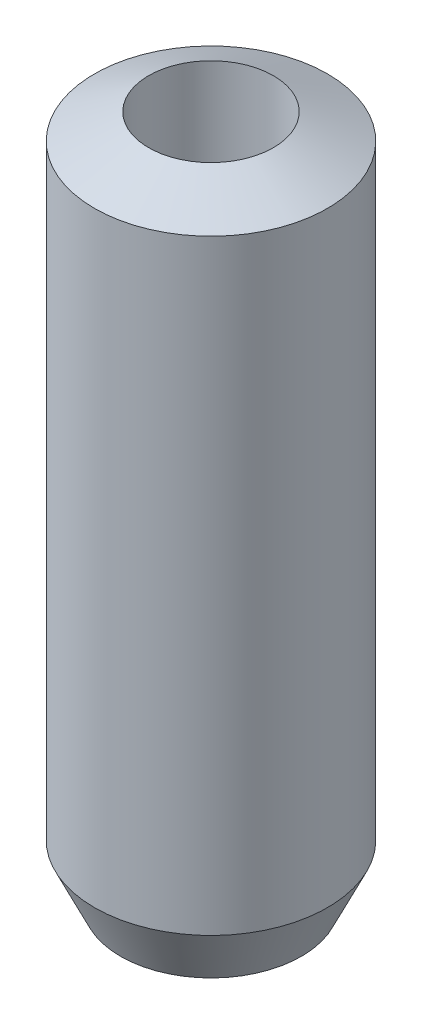
ISO-10303-21;
HEADER;
FILE_DESCRIPTION(('STEP AP214'),'2;1');
FILE_NAME('part.step','',(''),(''),'','','');
FILE_SCHEMA(('AUTOMOTIVE_DESIGN { 1 0 10303 214 1 1 1 1 }'));
ENDSEC;
DATA;
#1=APPLICATION_CONTEXT('core data for automotive mechanical design processes');
#2=APPLICATION_PROTOCOL_DEFINITION('international standard','automotive_design',2000,#1);
#3=PRODUCT_CONTEXT('',#1,'mechanical');
#4=PRODUCT('Part','Part','',(#3));
#5=PRODUCT_RELATED_PRODUCT_CATEGORY('part','',(#4));
#6=PRODUCT_DEFINITION_FORMATION('','',#4);
#7=PRODUCT_DEFINITION_CONTEXT('part definition',#1,'design');
#8=PRODUCT_DEFINITION('design','',#6,#7);
#9=PRODUCT_DEFINITION_SHAPE('','',#8);
#10=(LENGTH_UNIT() NAMED_UNIT(*) SI_UNIT(.MILLI.,.METRE.));
#11=(NAMED_UNIT(*) PLANE_ANGLE_UNIT() SI_UNIT($,.RADIAN.));
#12=(NAMED_UNIT(*) SI_UNIT($,.STERADIAN.) SOLID_ANGLE_UNIT());
#13=UNCERTAINTY_MEASURE_WITH_UNIT(LENGTH_MEASURE(1.E-05),#10,'distance_accuracy_value','');
#14=(GEOMETRIC_REPRESENTATION_CONTEXT(3) GLOBAL_UNCERTAINTY_ASSIGNED_CONTEXT((#13)) GLOBAL_UNIT_ASSIGNED_CONTEXT((#10,
#11,#12)) REPRESENTATION_CONTEXT('',''));
#15=CARTESIAN_POINT('',(0.,0.,0.));
#16=DIRECTION('',(0.,0.,1.));
#17=DIRECTION('',(1.,0.,0.));
#18=AXIS2_PLACEMENT_3D('',#15,#16,#17);
#19=CARTESIAN_POINT('',(0.,58.9361552721184,0.));
#20=DIRECTION('',(0.,-1.,0.));
#21=DIRECTION('',(0.,0.,-1.));
#22=AXIS2_PLACEMENT_3D('',#19,#20,#21);
#23=CYLINDRICAL_SURFACE('',#22,10.);
#24=CARTESIAN_POINT('',(0.,56.7048521358118,0.));
#25=DIRECTION('',(0.,1.,0.));
#26=DIRECTION('',(0.,0.,1.));
#27=AXIS2_PLACEMENT_3D('',#24,#25,#26);
#28=CIRCLE('',#27,10.);
#29=CARTESIAN_POINT('',(0.,56.7048521358118,-10.));
#30=VERTEX_POINT('',#29);
#31=EDGE_CURVE('E50',#30,#30,#28,.F.);
#32=ORIENTED_EDGE('',*,*,#31,.T.);
#33=EDGE_LOOP('',(#32));
#34=FACE_BOUND('',#33,.T.);
#35=CARTESIAN_POINT('',(0.,4.73732251438508,0.));
#36=DIRECTION('',(0.,1.,0.));
#37=DIRECTION('',(0.,0.,1.));
#38=AXIS2_PLACEMENT_3D('',#35,#36,#37);
#39=CIRCLE('',#38,10.);
#40=CARTESIAN_POINT('',(0.,4.73732251438508,10.));
#41=VERTEX_POINT('',#40);
#42=EDGE_CURVE('E51',#41,#41,#39,.T.);
#43=ORIENTED_EDGE('',*,*,#42,.T.);
#44=EDGE_LOOP('',(#43));
#45=FACE_BOUND('',#44,.T.);
#46=ADVANCED_FACE('F39',(#34,#45),#23,.T.);
#47=CARTESIAN_POINT('',(0.,0.,0.));
#48=DIRECTION('',(0.,1.,0.));
#49=DIRECTION('',(0.,0.,1.));
#50=AXIS2_PLACEMENT_3D('',#47,#48,#49);
#51=PLANE('',#50);
#52=CARTESIAN_POINT('',(0.,0.,0.));
#53=DIRECTION('',(0.,1.,0.));
#54=DIRECTION('',(0.,0.,1.));
#55=AXIS2_PLACEMENT_3D('',#52,#53,#54);
#56=CIRCLE('',#55,7.76869686369342);
#57=CARTESIAN_POINT('',(0.,0.,7.76869686369342));
#58=VERTEX_POINT('',#57);
#59=EDGE_CURVE('E10',#58,#58,#56,.F.);
#60=ORIENTED_EDGE('',*,*,#59,.T.);
#61=EDGE_LOOP('',(#60));
#62=FACE_BOUND('',#61,.T.);
#63=CARTESIAN_POINT('',(0.,0.,0.));
#64=DIRECTION('',(0.,1.,0.));
#65=DIRECTION('',(0.,0.,1.));
#66=AXIS2_PLACEMENT_3D('',#63,#64,#65);
#67=CIRCLE('',#66,5.35534448625057);
#68=CARTESIAN_POINT('',(0.,0.,5.35534448625057));
#69=VERTEX_POINT('',#68);
#70=EDGE_CURVE('E58',#69,#69,#67,.T.);
#71=ORIENTED_EDGE('',*,*,#70,.T.);
#72=EDGE_LOOP('',(#71));
#73=FACE_BOUND('',#72,.T.);
#74=ADVANCED_FACE('F62',(#62,#73),#51,.F.);
#75=CARTESIAN_POINT('',(0.,58.9361552721184,0.));
#76=DIRECTION('',(0.,-1.,0.));
#77=DIRECTION('',(0.,0.,-1.));
#78=AXIS2_PLACEMENT_3D('',#75,#76,#77);
#79=CYLINDRICAL_SURFACE('',#78,5.35534448625057);
#80=CARTESIAN_POINT('',(0.,58.892508640815,0.));
#81=DIRECTION('',(0.,-1.,0.));
#82=DIRECTION('',(0.,0.,-1.));
#83=AXIS2_PLACEMENT_3D('',#80,#81,#82);
#84=CIRCLE('',#83,5.35534448625057);
#85=CARTESIAN_POINT('',(0.,58.892508640815,-5.35534448625056));
#86=VERTEX_POINT('',#85);
#87=EDGE_CURVE('E54',#86,#86,#84,.F.);
#88=ORIENTED_EDGE('',*,*,#87,.T.);
#89=EDGE_LOOP('',(#88));
#90=FACE_BOUND('',#89,.T.);
#91=ORIENTED_EDGE('',*,*,#70,.F.);
#92=EDGE_LOOP('',(#91));
#93=FACE_BOUND('',#92,.T.);
#94=ADVANCED_FACE('F68',(#90,#93),#79,.F.);
#95=CARTESIAN_POINT('',(0.,58.9361552721184,0.));
#96=DIRECTION('',(0.,-1.,0.));
#97=DIRECTION('',(0.,0.,-1.));
#98=AXIS2_PLACEMENT_3D('',#95,#96,#97);
#99=CONICAL_SURFACE('',#98,5.26267748561476,1.13061250057541);
#100=CARTESIAN_POINT('',(0.,56.7048521358118,-10.));
#101=CARTESIAN_POINT('',(0.,56.7276402244056,-9.95161817173178));
#102=CARTESIAN_POINT('',(0.,56.7504283129994,-9.90323634346356));
#103=CARTESIAN_POINT('',(0.,56.796004490187,-9.80647268692712));
#104=CARTESIAN_POINT('',(0.,56.8187925787807,-9.75809085865889));
#105=CARTESIAN_POINT('',(0.,56.8643687559683,-9.66132720212245));
#106=CARTESIAN_POINT('',(0.,56.8871568445621,-9.61294537385422));
#107=CARTESIAN_POINT('',(0.,56.9327330217496,-9.51618171731777));
#108=CARTESIAN_POINT('',(0.,56.9555211103434,-9.46779988904955));
#109=CARTESIAN_POINT('',(0.,57.001097287531,-9.37103623251311));
#110=CARTESIAN_POINT('',(0.,57.0238853761248,-9.32265440424488));
#111=CARTESIAN_POINT('',(0.,57.0694615533124,-9.22589074770844));
#112=CARTESIAN_POINT('',(0.,57.0922496419061,-9.17750891944021));
#113=CARTESIAN_POINT('',(0.,57.1378258190937,-9.08074526290376));
#114=CARTESIAN_POINT('',(0.,57.1606139076875,-9.03236343463554));
#115=CARTESIAN_POINT('',(0.,57.206190084875,-8.93559977809909));
#116=CARTESIAN_POINT('',(0.,57.2289781734688,-8.88721794983087));
#117=CARTESIAN_POINT('',(0.,57.2745543506564,-8.79045429329443));
#118=CARTESIAN_POINT('',(0.,57.2973424392502,-8.7420724650262));
#119=CARTESIAN_POINT('',(0.,57.3429186164377,-8.64530880848975));
#120=CARTESIAN_POINT('',(0.,57.3657067050315,-8.59692698022153));
#121=CARTESIAN_POINT('',(0.,57.4112828822191,-8.50016332368508));
#122=CARTESIAN_POINT('',(0.,57.4340709708129,-8.45178149541686));
#123=CARTESIAN_POINT('',(0.,57.4796471480004,-8.35501783888041));
#124=CARTESIAN_POINT('',(0.,57.5024352365942,-8.30663601061219));
#125=CARTESIAN_POINT('',(0.,57.5480114137818,-8.20987235407574));
#126=CARTESIAN_POINT('',(0.,57.5707995023756,-8.16149052580752));
#127=CARTESIAN_POINT('',(0.,57.6163756795631,-8.06472686927107));
#128=CARTESIAN_POINT('',(0.,57.6391637681569,-8.01634504100285));
#129=CARTESIAN_POINT('',(0.,57.6847399453445,-7.9195813844664));
#130=CARTESIAN_POINT('',(0.,57.7075280339383,-7.87119955619818));
#131=CARTESIAN_POINT('',(0.,57.7531042111258,-7.77443589966173));
#132=CARTESIAN_POINT('',(0.,57.7758922997196,-7.72605407139351));
#133=CARTESIAN_POINT('',(0.,57.8214684769072,-7.62929041485706));
#134=CARTESIAN_POINT('',(0.,57.844256565501,-7.58090858658884));
#135=CARTESIAN_POINT('',(0.,57.8898327426886,-7.48414493005239));
#136=CARTESIAN_POINT('',(0.,57.9126208312823,-7.43576310178417));
#137=CARTESIAN_POINT('',(0.,57.9581970084699,-7.33899944524772));
#138=CARTESIAN_POINT('',(0.,57.9809850970637,-7.2906176169795));
#139=CARTESIAN_POINT('',(0.,58.0265612742513,-7.19385396044305));
#140=CARTESIAN_POINT('',(0.,58.049349362845,-7.14547213217483));
#141=CARTESIAN_POINT('',(0.,58.0949255400326,-7.04870847563838));
#142=CARTESIAN_POINT('',(0.,58.1177136286264,-7.00032664737016));
#143=CARTESIAN_POINT('',(0.,58.163289805814,-6.90356299083371));
#144=CARTESIAN_POINT('',(0.,58.1860778944077,-6.85518116256549));
#145=CARTESIAN_POINT('',(0.,58.2316540715953,-6.75841750602904));
#146=CARTESIAN_POINT('',(0.,58.2544421601891,-6.71003567776082));
#147=CARTESIAN_POINT('',(0.,58.3000183373766,-6.61327202122437));
#148=CARTESIAN_POINT('',(0.,58.3228064259704,-6.56489019295615));
#149=CARTESIAN_POINT('',(0.,58.368382603158,-6.4681265364197));
#150=CARTESIAN_POINT('',(0.,58.3911706917518,-6.41974470815148));
#151=CARTESIAN_POINT('',(0.,58.4367468689394,-6.32298105161503));
#152=CARTESIAN_POINT('',(0.,58.4595349575331,-6.27459922334681));
#153=CARTESIAN_POINT('',(0.,58.5051111347207,-6.17783556681036));
#154=CARTESIAN_POINT('',(0.,58.5278992233145,-6.12945373854214));
#155=CARTESIAN_POINT('',(0.,58.573475400502,-6.03269008200569));
#156=CARTESIAN_POINT('',(0.,58.5962634890958,-5.98430825373747));
#157=CARTESIAN_POINT('',(0.,58.6418396662834,-5.88754459720102));
#158=CARTESIAN_POINT('',(0.,58.6646277548772,-5.83916276893279));
#159=CARTESIAN_POINT('',(0.,58.7102039320648,-5.74239911239635));
#160=CARTESIAN_POINT('',(0.,58.7329920206585,-5.69401728412812));
#161=CARTESIAN_POINT('',(0.,58.7785681978461,-5.59725362759168));
#162=CARTESIAN_POINT('',(0.,58.8013562864399,-5.54887179932345));
#163=CARTESIAN_POINT('',(0.,58.8469324636274,-5.45210814278701));
#164=CARTESIAN_POINT('',(0.,58.8697205522212,-5.40372631451878));
#165=CARTESIAN_POINT('',(0.,58.892508640815,-5.35534448625056));
#166=B_SPLINE_CURVE_WITH_KNOTS('',3,(#100,#101,#102,#103,#104,#105,#106,#107,#108,#109,#110,
#111,#112,#113,#114,#115,#116,#117,#118,#119,#120,#121,#122,#123,#124,#125,#126,#127,#128,#129,
#130,#131,#132,#133,#134,#135,#136,#137,#138,#139,#140,#141,#142,#143,#144,#145,#146,#147,#148,
#149,#150,#151,#152,#153,#154,#155,#156,#157,#158,#159,#160,#161,#162,#163,#164,#165),
.UNSPECIFIED.,.F.,.F.,(4,2,2,2,2,2,2,2,2,2,2,2,2,2,2,2,2,2,2,2,2,2,2,2,2,2,2,2,2,2,2,2,4),(0.,
0.160439660293226,0.320879320586454,0.481318980879681,0.641758641172907,0.802198301466132,
0.962637961759359,1.12307762205258,1.28351728234581,1.44395694263904,1.60439660293226,
1.76483626322549,1.92527592351872,2.08571558381194,2.24615524410517,2.40659490439839,
2.56703456469162,2.72747422498485,2.88791388527808,3.0483535455713,3.20879320586453,
3.36923286615775,3.52967252645098,3.69011218674421,3.85055184703743,4.01099150733066,
4.17143116762388,4.33187082791711,4.49231048821034,4.65275014850356,4.81318980879679,
4.97362946909001,5.13406912938324),.UNSPECIFIED.);
#167=EDGE_CURVE('BSEAM66',#30,#86,#166,.T.);
#168=ORIENTED_EDGE('',*,*,#31,.F.);
#169=ORIENTED_EDGE('',*,*,#87,.F.);
#170=ORIENTED_EDGE('',*,*,#167,.T.);
#171=ORIENTED_EDGE('',*,*,#167,.F.);
#172=EDGE_LOOP('',(#168,#170,#169,#171));
#173=FACE_BOUND('',#172,.T.);
#174=ADVANCED_FACE('F66',(#173),#99,.T.);
#175=CARTESIAN_POINT('',(0.,4.73732251438508,0.));
#176=DIRECTION('',(0.,1.,0.));
#177=DIRECTION('',(0.,0.,1.));
#178=AXIS2_PLACEMENT_3D('',#175,#176,#177);
#179=CONICAL_SURFACE('',#178,10.,0.440183826219494);
#180=ORIENTED_EDGE('',*,*,#59,.F.);
#181=EDGE_LOOP('',(#180));
#182=FACE_BOUND('',#181,.T.);
#183=ORIENTED_EDGE('',*,*,#42,.F.);
#184=EDGE_LOOP('',(#183));
#185=FACE_BOUND('',#184,.T.);
#186=ADVANCED_FACE('F45',(#182,#185),#179,.T.);
#187=CLOSED_SHELL('',(#46,#74,#94,#174,#186));
#188=MANIFOLD_SOLID_BREP('B2',#187);
#189=ADVANCED_BREP_SHAPE_REPRESENTATION('',(#18,#188),#14);
#190=SHAPE_DEFINITION_REPRESENTATION(#9,#189);
ENDSEC;
END-ISO-10303-21;
